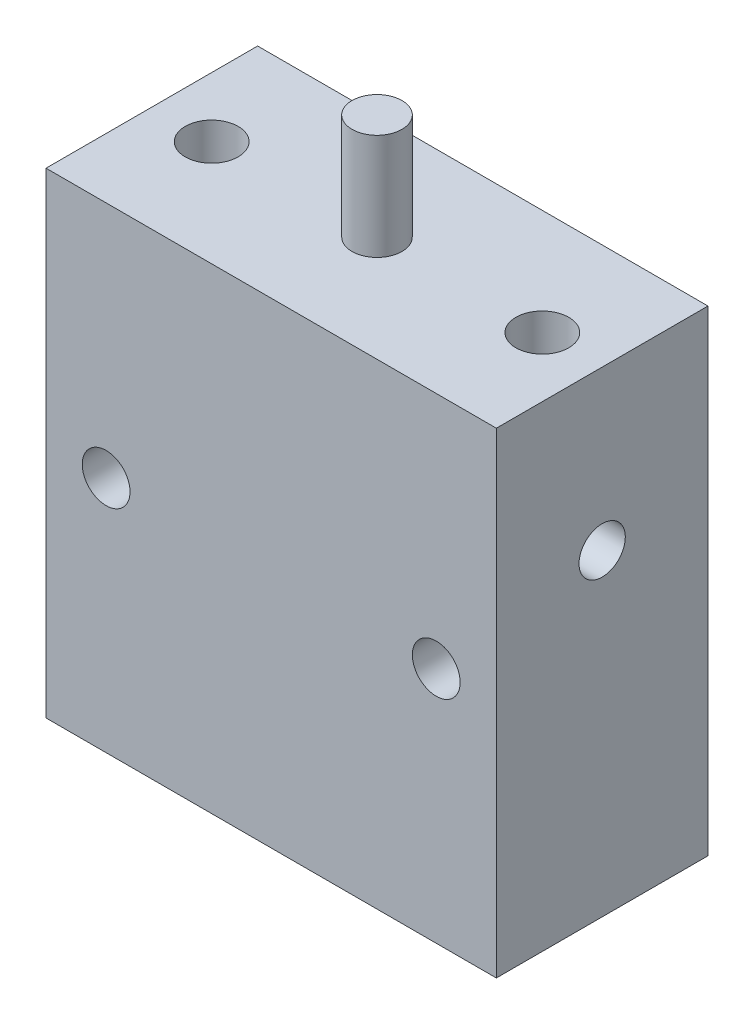
ISO-10303-21;
HEADER;
FILE_DESCRIPTION(('STEP AP214'),'2;1');
FILE_NAME('part.step','',(''),(''),'','','');
FILE_SCHEMA(('AUTOMOTIVE_DESIGN { 1 0 10303 214 1 1 1 1 }'));
ENDSEC;
DATA;
#1=APPLICATION_CONTEXT('core data for automotive mechanical design processes');
#2=APPLICATION_PROTOCOL_DEFINITION('international standard','automotive_design',2000,#1);
#3=PRODUCT_CONTEXT('',#1,'mechanical');
#4=PRODUCT('Part','Part','',(#3));
#5=PRODUCT_RELATED_PRODUCT_CATEGORY('part','',(#4));
#6=PRODUCT_DEFINITION_FORMATION('','',#4);
#7=PRODUCT_DEFINITION_CONTEXT('part definition',#1,'design');
#8=PRODUCT_DEFINITION('design','',#6,#7);
#9=PRODUCT_DEFINITION_SHAPE('','',#8);
#10=(LENGTH_UNIT() NAMED_UNIT(*) SI_UNIT(.MILLI.,.METRE.));
#11=(NAMED_UNIT(*) PLANE_ANGLE_UNIT() SI_UNIT($,.RADIAN.));
#12=(NAMED_UNIT(*) SI_UNIT($,.STERADIAN.) SOLID_ANGLE_UNIT());
#13=UNCERTAINTY_MEASURE_WITH_UNIT(LENGTH_MEASURE(1.E-05),#10,'distance_accuracy_value','');
#14=(GEOMETRIC_REPRESENTATION_CONTEXT(3) GLOBAL_UNCERTAINTY_ASSIGNED_CONTEXT((#13)) GLOBAL_UNIT_ASSIGNED_CONTEXT((#10,
#11,#12)) REPRESENTATION_CONTEXT('',''));
#15=CARTESIAN_POINT('',(0.,0.,0.));
#16=DIRECTION('',(0.,0.,1.));
#17=DIRECTION('',(1.,0.,0.));
#18=AXIS2_PLACEMENT_3D('',#15,#16,#17);
#19=CARTESIAN_POINT('',(-13.5128,38.5572,6.35));
#20=DIRECTION('',(1.,0.,0.));
#21=DIRECTION('',(0.,1.,0.));
#22=AXIS2_PLACEMENT_3D('',#19,#20,#21);
#23=PLANE('',#22);
#24=DIRECTION('',(0.,0.,-1.));
#25=VECTOR('',#24,1.);
#26=CARTESIAN_POINT('',(-13.5128,38.5572,6.35));
#27=LINE('',#26,#25);
#28=CARTESIAN_POINT('',(-13.5128,38.5572,6.35));
#29=VERTEX_POINT('',#28);
#30=CARTESIAN_POINT('',(-13.5128,38.5572,-6.35));
#31=VERTEX_POINT('',#30);
#32=EDGE_CURVE('E420',#29,#31,#27,.T.);
#33=ORIENTED_EDGE('',*,*,#32,.T.);
#34=DIRECTION('',(0.,-1.,0.));
#35=VECTOR('',#34,1.);
#36=CARTESIAN_POINT('',(-13.5128,38.5572,-6.35));
#37=LINE('',#36,#35);
#38=CARTESIAN_POINT('',(-13.5128,9.9822,-6.35));
#39=VERTEX_POINT('',#38);
#40=EDGE_CURVE('E414',#31,#39,#37,.T.);
#41=ORIENTED_EDGE('',*,*,#40,.T.);
#42=DIRECTION('',(0.,0.,-1.));
#43=VECTOR('',#42,1.);
#44=CARTESIAN_POINT('',(-13.5128,9.9822,6.35));
#45=LINE('',#44,#43);
#46=CARTESIAN_POINT('',(-13.5128,9.9822,6.35));
#47=VERTEX_POINT('',#46);
#48=EDGE_CURVE('E367',#47,#39,#45,.T.);
#49=ORIENTED_EDGE('',*,*,#48,.F.);
#50=DIRECTION('',(0.,-1.,0.));
#51=VECTOR('',#50,1.);
#52=CARTESIAN_POINT('',(-13.5128,38.5572,6.35));
#53=LINE('',#52,#51);
#54=EDGE_CURVE('E437',#29,#47,#53,.T.);
#55=ORIENTED_EDGE('',*,*,#54,.F.);
#56=EDGE_LOOP('',(#33,#41,#49,#55));
#57=FACE_BOUND('',#56,.T.);
#58=CARTESIAN_POINT('',(-13.5128,29.0322,0.));
#59=DIRECTION('',(1.,0.,0.));
#60=DIRECTION('',(0.,1.,0.));
#61=AXIS2_PLACEMENT_3D('',#58,#59,#60);
#62=CIRCLE('',#61,1.3890625);
#63=CARTESIAN_POINT('',(-13.5128,30.4212625,0.));
#64=VERTEX_POINT('',#63);
#65=EDGE_CURVE('E485',#64,#64,#62,.F.);
#66=ORIENTED_EDGE('',*,*,#65,.F.);
#67=EDGE_LOOP('',(#66));
#68=FACE_BOUND('',#67,.T.);
#69=ADVANCED_FACE('F360',(#57,#68),#23,.F.);
#70=CARTESIAN_POINT('',(13.5128,38.5572,6.35));
#71=DIRECTION('',(-1.,0.,0.));
#72=DIRECTION('',(0.,-1.,0.));
#73=AXIS2_PLACEMENT_3D('',#70,#71,#72);
#74=PLANE('',#73);
#75=DIRECTION('',(0.,0.,-1.));
#76=VECTOR('',#75,1.);
#77=CARTESIAN_POINT('',(13.5128,9.9822,6.35));
#78=LINE('',#77,#76);
#79=CARTESIAN_POINT('',(13.5128,9.9822,6.35));
#80=VERTEX_POINT('',#79);
#81=CARTESIAN_POINT('',(13.5128,9.9822,-6.35));
#82=VERTEX_POINT('',#81);
#83=EDGE_CURVE('E408',#80,#82,#78,.T.);
#84=ORIENTED_EDGE('',*,*,#83,.T.);
#85=DIRECTION('',(0.,1.,0.));
#86=VECTOR('',#85,1.);
#87=CARTESIAN_POINT('',(13.5128,38.5572,-6.35));
#88=LINE('',#87,#86);
#89=CARTESIAN_POINT('',(13.5128,38.5572,-6.35));
#90=VERTEX_POINT('',#89);
#91=EDGE_CURVE('E417',#82,#90,#88,.T.);
#92=ORIENTED_EDGE('',*,*,#91,.T.);
#93=DIRECTION('',(0.,0.,-1.));
#94=VECTOR('',#93,1.);
#95=CARTESIAN_POINT('',(13.5128,38.5572,6.35));
#96=LINE('',#95,#94);
#97=CARTESIAN_POINT('',(13.5128,38.5572,6.35));
#98=VERTEX_POINT('',#97);
#99=EDGE_CURVE('E443',#98,#90,#96,.T.);
#100=ORIENTED_EDGE('',*,*,#99,.F.);
#101=DIRECTION('',(0.,1.,0.));
#102=VECTOR('',#101,1.);
#103=CARTESIAN_POINT('',(13.5128,38.5572,6.35));
#104=LINE('',#103,#102);
#105=EDGE_CURVE('E379',#80,#98,#104,.T.);
#106=ORIENTED_EDGE('',*,*,#105,.F.);
#107=EDGE_LOOP('',(#84,#92,#100,#106));
#108=FACE_BOUND('',#107,.T.);
#109=CARTESIAN_POINT('',(13.5128,29.0322,0.));
#110=DIRECTION('',(-1.,0.,0.));
#111=DIRECTION('',(0.,-1.,0.));
#112=AXIS2_PLACEMENT_3D('',#109,#110,#111);
#113=CIRCLE('',#112,1.3890625);
#114=CARTESIAN_POINT('',(13.5128,27.6431375,0.));
#115=VERTEX_POINT('',#114);
#116=EDGE_CURVE('E482',#115,#115,#113,.T.);
#117=ORIENTED_EDGE('',*,*,#116,.T.);
#118=EDGE_LOOP('',(#117));
#119=FACE_BOUND('',#118,.T.);
#120=ADVANCED_FACE('F446',(#108,#119),#74,.F.);
#121=CARTESIAN_POINT('',(-13.5128,38.5572,6.35));
#122=DIRECTION('',(0.,-1.,0.));
#123=DIRECTION('',(0.,0.,-1.));
#124=AXIS2_PLACEMENT_3D('',#121,#122,#123);
#125=PLANE('',#124);
#126=CARTESIAN_POINT('',(-9.921875,38.5572,0.));
#127=DIRECTION('',(0.,1.,0.));
#128=DIRECTION('',(0.,0.,-1.));
#129=AXIS2_PLACEMENT_3D('',#126,#127,#128);
#130=CIRCLE('',#129,1.5875);
#131=CARTESIAN_POINT('',(-9.921875,38.5572,1.5875));
#132=VERTEX_POINT('',#131);
#133=EDGE_CURVE('E479',#132,#132,#130,.T.);
#134=ORIENTED_EDGE('',*,*,#133,.F.);
#135=EDGE_LOOP('',(#134));
#136=FACE_BOUND('',#135,.T.);
#137=CARTESIAN_POINT('',(9.921875,38.5572,0.));
#138=DIRECTION('',(0.,1.,0.));
#139=DIRECTION('',(0.,0.,1.));
#140=AXIS2_PLACEMENT_3D('',#137,#138,#139);
#141=CIRCLE('',#140,1.5875);
#142=CARTESIAN_POINT('',(9.921875,38.5572,1.5875));
#143=VERTEX_POINT('',#142);
#144=EDGE_CURVE('E473',#143,#143,#141,.T.);
#145=ORIENTED_EDGE('',*,*,#144,.F.);
#146=EDGE_LOOP('',(#145));
#147=FACE_BOUND('',#146,.T.);
#148=ORIENTED_EDGE('',*,*,#99,.T.);
#149=DIRECTION('',(-1.,0.,0.));
#150=VECTOR('',#149,1.);
#151=CARTESIAN_POINT('',(-13.5128,38.5572,-6.35));
#152=LINE('',#151,#150);
#153=EDGE_CURVE('E429',#90,#31,#152,.T.);
#154=ORIENTED_EDGE('',*,*,#153,.T.);
#155=ORIENTED_EDGE('',*,*,#32,.F.);
#156=DIRECTION('',(-1.,0.,0.));
#157=VECTOR('',#156,1.);
#158=CARTESIAN_POINT('',(-13.5128,38.5572,6.35));
#159=LINE('',#158,#157);
#160=EDGE_CURVE('E374',#98,#29,#159,.T.);
#161=ORIENTED_EDGE('',*,*,#160,.F.);
#162=EDGE_LOOP('',(#148,#154,#155,#161));
#163=FACE_BOUND('',#162,.T.);
#164=CARTESIAN_POINT('',(0.,38.5572,0.));
#165=DIRECTION('',(0.,-1.,0.));
#166=DIRECTION('',(0.,0.,-1.));
#167=AXIS2_PLACEMENT_3D('',#164,#165,#166);
#168=CIRCLE('',#167,1.4986);
#169=CARTESIAN_POINT('',(0.,38.5572,-1.4986));
#170=VERTEX_POINT('',#169);
#171=EDGE_CURVE('E11',#170,#170,#168,.F.);
#172=ORIENTED_EDGE('',*,*,#171,.F.);
#173=EDGE_LOOP('',(#172));
#174=FACE_BOUND('',#173,.T.);
#175=ADVANCED_FACE('F449',(#136,#147,#163,#174),#125,.F.);
#176=CARTESIAN_POINT('',(-13.5128,9.9822,6.35));
#177=DIRECTION('',(0.,0.,1.));
#178=DIRECTION('',(1.,0.,0.));
#179=AXIS2_PLACEMENT_3D('',#176,#177,#178);
#180=PLANE('',#179);
#181=CARTESIAN_POINT('',(-9.906,24.257,6.35));
#182=DIRECTION('',(0.,0.,1.));
#183=DIRECTION('',(1.,0.,0.));
#184=AXIS2_PLACEMENT_3D('',#181,#182,#183);
#185=CIRCLE('',#184,1.4351);
#186=CARTESIAN_POINT('',(-8.4709,24.257,6.35));
#187=VERTEX_POINT('',#186);
#188=EDGE_CURVE('E434',#187,#187,#185,.T.);
#189=ORIENTED_EDGE('',*,*,#188,.F.);
#190=EDGE_LOOP('',(#189));
#191=FACE_BOUND('',#190,.T.);
#192=ORIENTED_EDGE('',*,*,#54,.T.);
#193=DIRECTION('',(1.,0.,0.));
#194=VECTOR('',#193,1.);
#195=CARTESIAN_POINT('',(-13.5128,9.9822,6.35));
#196=LINE('',#195,#194);
#197=EDGE_CURVE('E404',#47,#80,#196,.T.);
#198=ORIENTED_EDGE('',*,*,#197,.T.);
#199=ORIENTED_EDGE('',*,*,#105,.T.);
#200=ORIENTED_EDGE('',*,*,#160,.T.);
#201=EDGE_LOOP('',(#192,#198,#199,#200));
#202=FACE_BOUND('',#201,.T.);
#203=CARTESIAN_POINT('',(9.906,24.257,6.35));
#204=DIRECTION('',(0.,0.,1.));
#205=DIRECTION('',(1.,0.,0.));
#206=AXIS2_PLACEMENT_3D('',#203,#204,#205);
#207=CIRCLE('',#206,1.4351);
#208=CARTESIAN_POINT('',(11.3411,24.257,6.35));
#209=VERTEX_POINT('',#208);
#210=EDGE_CURVE('E431',#209,#209,#207,.T.);
#211=ORIENTED_EDGE('',*,*,#210,.F.);
#212=EDGE_LOOP('',(#211));
#213=FACE_BOUND('',#212,.T.);
#214=ADVANCED_FACE('F451',(#191,#202,#213),#180,.T.);
#215=CARTESIAN_POINT('',(-13.5128,9.9822,6.35));
#216=DIRECTION('',(0.,1.,0.));
#217=DIRECTION('',(0.,0.,1.));
#218=AXIS2_PLACEMENT_3D('',#215,#216,#217);
#219=PLANE('',#218);
#220=ORIENTED_EDGE('',*,*,#48,.T.);
#221=DIRECTION('',(1.,0.,0.));
#222=VECTOR('',#221,1.);
#223=CARTESIAN_POINT('',(-13.5128,9.9822,-6.35));
#224=LINE('',#223,#222);
#225=EDGE_CURVE('E403',#39,#82,#224,.T.);
#226=ORIENTED_EDGE('',*,*,#225,.T.);
#227=ORIENTED_EDGE('',*,*,#83,.F.);
#228=ORIENTED_EDGE('',*,*,#197,.F.);
#229=EDGE_LOOP('',(#220,#226,#227,#228));
#230=FACE_BOUND('',#229,.T.);
#231=ADVANCED_FACE('F401',(#230),#219,.F.);
#232=CARTESIAN_POINT('',(-9.906,24.257,6.35));
#233=DIRECTION('',(0.,0.,-1.));
#234=DIRECTION('',(-1.,0.,0.));
#235=AXIS2_PLACEMENT_3D('',#232,#233,#234);
#236=CYLINDRICAL_SURFACE('',#235,1.4351);
#237=ORIENTED_EDGE('',*,*,#188,.T.);
#238=EDGE_LOOP('',(#237));
#239=FACE_BOUND('',#238,.T.);
#240=CARTESIAN_POINT('',(-9.906,24.257,-6.35));
#241=DIRECTION('',(0.,0.,1.));
#242=DIRECTION('',(1.,0.,0.));
#243=AXIS2_PLACEMENT_3D('',#240,#241,#242);
#244=CIRCLE('',#243,1.4351);
#245=CARTESIAN_POINT('',(-8.4709,24.257,-6.35));
#246=VERTEX_POINT('',#245);
#247=EDGE_CURVE('E421',#246,#246,#244,.T.);
#248=ORIENTED_EDGE('',*,*,#247,.F.);
#249=EDGE_LOOP('',(#248));
#250=FACE_BOUND('',#249,.T.);
#251=ADVANCED_FACE('F461',(#239,#250),#236,.F.);
#252=CARTESIAN_POINT('',(9.906,24.257,6.35));
#253=DIRECTION('',(0.,0.,-1.));
#254=DIRECTION('',(-1.,0.,0.));
#255=AXIS2_PLACEMENT_3D('',#252,#253,#254);
#256=CYLINDRICAL_SURFACE('',#255,1.4351);
#257=ORIENTED_EDGE('',*,*,#210,.T.);
#258=EDGE_LOOP('',(#257));
#259=FACE_BOUND('',#258,.T.);
#260=CARTESIAN_POINT('',(9.906,24.257,-6.35));
#261=DIRECTION('',(0.,0.,1.));
#262=DIRECTION('',(1.,0.,0.));
#263=AXIS2_PLACEMENT_3D('',#260,#261,#262);
#264=CIRCLE('',#263,1.4351);
#265=CARTESIAN_POINT('',(11.3411,24.257,-6.35));
#266=VERTEX_POINT('',#265);
#267=EDGE_CURVE('E424',#266,#266,#264,.T.);
#268=ORIENTED_EDGE('',*,*,#267,.F.);
#269=EDGE_LOOP('',(#268));
#270=FACE_BOUND('',#269,.T.);
#271=ADVANCED_FACE('F458',(#259,#270),#256,.F.);
#272=CARTESIAN_POINT('',(-13.5128,9.9822,-6.35));
#273=DIRECTION('',(0.,0.,1.));
#274=DIRECTION('',(1.,0.,0.));
#275=AXIS2_PLACEMENT_3D('',#272,#273,#274);
#276=PLANE('',#275);
#277=ORIENTED_EDGE('',*,*,#267,.T.);
#278=EDGE_LOOP('',(#277));
#279=FACE_BOUND('',#278,.T.);
#280=ORIENTED_EDGE('',*,*,#247,.T.);
#281=EDGE_LOOP('',(#280));
#282=FACE_BOUND('',#281,.T.);
#283=ORIENTED_EDGE('',*,*,#40,.F.);
#284=ORIENTED_EDGE('',*,*,#153,.F.);
#285=ORIENTED_EDGE('',*,*,#91,.F.);
#286=ORIENTED_EDGE('',*,*,#225,.F.);
#287=EDGE_LOOP('',(#283,#284,#285,#286));
#288=FACE_BOUND('',#287,.T.);
#289=ADVANCED_FACE('F412',(#279,#282,#288),#276,.F.);
#290=CARTESIAN_POINT('',(0.,44.9072,0.));
#291=DIRECTION('',(0.,-1.,0.));
#292=DIRECTION('',(0.,0.,-1.));
#293=AXIS2_PLACEMENT_3D('',#290,#291,#292);
#294=CYLINDRICAL_SURFACE('',#293,1.4986);
#295=CARTESIAN_POINT('',(0.,44.9072,0.));
#296=DIRECTION('',(0.,1.,0.));
#297=DIRECTION('',(0.,0.,1.));
#298=AXIS2_PLACEMENT_3D('',#295,#296,#297);
#299=CIRCLE('',#298,1.4986);
#300=CARTESIAN_POINT('',(0.,44.9072,1.4986));
#301=VERTEX_POINT('',#300);
#302=EDGE_CURVE('E466',#301,#301,#299,.T.);
#303=ORIENTED_EDGE('',*,*,#302,.F.);
#304=EDGE_LOOP('',(#303));
#305=FACE_BOUND('',#304,.T.);
#306=ORIENTED_EDGE('',*,*,#171,.T.);
#307=EDGE_LOOP('',(#306));
#308=FACE_BOUND('',#307,.T.);
#309=ADVANCED_FACE('F517',(#305,#308),#294,.T.);
#310=CARTESIAN_POINT('',(0.,44.9072,0.));
#311=DIRECTION('',(0.,1.,0.));
#312=DIRECTION('',(0.,0.,1.));
#313=AXIS2_PLACEMENT_3D('',#310,#311,#312);
#314=PLANE('',#313);
#315=ORIENTED_EDGE('',*,*,#302,.T.);
#316=EDGE_LOOP('',(#315));
#317=FACE_BOUND('',#316,.T.);
#318=ADVANCED_FACE('F520',(#317),#314,.T.);
#319=CARTESIAN_POINT('',(9.921875,33.7947,0.));
#320=DIRECTION('',(0.,1.,0.));
#321=DIRECTION('',(0.,0.,1.));
#322=AXIS2_PLACEMENT_3D('',#319,#320,#321);
#323=CYLINDRICAL_SURFACE('',#322,1.5875);
#324=CARTESIAN_POINT('',(9.921875,33.7947,0.));
#325=DIRECTION('',(0.,1.,0.));
#326=DIRECTION('',(0.,0.,1.));
#327=AXIS2_PLACEMENT_3D('',#324,#325,#326);
#328=CIRCLE('',#327,1.5875);
#329=CARTESIAN_POINT('',(9.921875,33.7947,1.5875));
#330=VERTEX_POINT('',#329);
#331=EDGE_CURVE('E468',#330,#330,#328,.T.);
#332=CARTESIAN_POINT('',(9.921875,33.7947,1.5875));
#333=CARTESIAN_POINT('',(9.921875,33.844309375,1.5875));
#334=CARTESIAN_POINT('',(9.921875,33.89391875,1.5875));
#335=CARTESIAN_POINT('',(9.921875,33.9931375,1.5875));
#336=CARTESIAN_POINT('',(9.921875,34.042746875,1.5875));
#337=CARTESIAN_POINT('',(9.921875,34.141965625,1.5875));
#338=CARTESIAN_POINT('',(9.921875,34.191575,1.5875));
#339=CARTESIAN_POINT('',(9.921875,34.29079375,1.5875));
#340=CARTESIAN_POINT('',(9.921875,34.340403125,1.5875));
#341=CARTESIAN_POINT('',(9.921875,34.439621875,1.5875));
#342=CARTESIAN_POINT('',(9.921875,34.48923125,1.5875));
#343=CARTESIAN_POINT('',(9.921875,34.58845,1.5875));
#344=CARTESIAN_POINT('',(9.921875,34.638059375,1.5875));
#345=CARTESIAN_POINT('',(9.921875,34.737278125,1.5875));
#346=CARTESIAN_POINT('',(9.921875,34.7868875,1.5875));
#347=CARTESIAN_POINT('',(9.921875,34.88610625,1.5875));
#348=CARTESIAN_POINT('',(9.921875,34.935715625,1.5875));
#349=CARTESIAN_POINT('',(9.921875,35.034934375,1.5875));
#350=CARTESIAN_POINT('',(9.921875,35.08454375,1.5875));
#351=CARTESIAN_POINT('',(9.921875,35.1837625,1.5875));
#352=CARTESIAN_POINT('',(9.921875,35.233371875,1.5875));
#353=CARTESIAN_POINT('',(9.921875,35.332590625,1.5875));
#354=CARTESIAN_POINT('',(9.921875,35.3822,1.5875));
#355=CARTESIAN_POINT('',(9.921875,35.48141875,1.5875));
#356=CARTESIAN_POINT('',(9.921875,35.531028125,1.5875));
#357=CARTESIAN_POINT('',(9.921875,35.630246875,1.5875));
#358=CARTESIAN_POINT('',(9.921875,35.67985625,1.5875));
#359=CARTESIAN_POINT('',(9.921875,35.779075,1.5875));
#360=CARTESIAN_POINT('',(9.921875,35.828684375,1.5875));
#361=CARTESIAN_POINT('',(9.921875,35.927903125,1.5875));
#362=CARTESIAN_POINT('',(9.921875,35.9775125,1.5875));
#363=CARTESIAN_POINT('',(9.921875,36.07673125,1.5875));
#364=CARTESIAN_POINT('',(9.921875,36.126340625,1.5875));
#365=CARTESIAN_POINT('',(9.921875,36.225559375,1.5875));
#366=CARTESIAN_POINT('',(9.921875,36.27516875,1.5875));
#367=CARTESIAN_POINT('',(9.921875,36.3743875,1.5875));
#368=CARTESIAN_POINT('',(9.921875,36.423996875,1.5875));
#369=CARTESIAN_POINT('',(9.921875,36.523215625,1.5875));
#370=CARTESIAN_POINT('',(9.921875,36.572825,1.5875));
#371=CARTESIAN_POINT('',(9.921875,36.67204375,1.5875));
#372=CARTESIAN_POINT('',(9.921875,36.721653125,1.5875));
#373=CARTESIAN_POINT('',(9.921875,36.820871875,1.5875));
#374=CARTESIAN_POINT('',(9.921875,36.87048125,1.5875));
#375=CARTESIAN_POINT('',(9.921875,36.9697,1.5875));
#376=CARTESIAN_POINT('',(9.921875,37.019309375,1.5875));
#377=CARTESIAN_POINT('',(9.921875,37.118528125,1.5875));
#378=CARTESIAN_POINT('',(9.921875,37.1681375,1.5875));
#379=CARTESIAN_POINT('',(9.921875,37.26735625,1.5875));
#380=CARTESIAN_POINT('',(9.921875,37.316965625,1.5875));
#381=CARTESIAN_POINT('',(9.921875,37.416184375,1.5875));
#382=CARTESIAN_POINT('',(9.921875,37.46579375,1.5875));
#383=CARTESIAN_POINT('',(9.921875,37.5650125,1.5875));
#384=CARTESIAN_POINT('',(9.921875,37.614621875,1.5875));
#385=CARTESIAN_POINT('',(9.921875,37.713840625,1.5875));
#386=CARTESIAN_POINT('',(9.921875,37.76345,1.5875));
#387=CARTESIAN_POINT('',(9.921875,37.86266875,1.5875));
#388=CARTESIAN_POINT('',(9.921875,37.912278125,1.5875));
#389=CARTESIAN_POINT('',(9.921875,38.011496875,1.5875));
#390=CARTESIAN_POINT('',(9.921875,38.06110625,1.5875));
#391=CARTESIAN_POINT('',(9.921875,38.160325,1.5875));
#392=CARTESIAN_POINT('',(9.921875,38.209934375,1.5875));
#393=CARTESIAN_POINT('',(9.921875,38.309153125,1.5875));
#394=CARTESIAN_POINT('',(9.921875,38.3587625,1.5875));
#395=CARTESIAN_POINT('',(9.921875,38.45798125,1.5875));
#396=CARTESIAN_POINT('',(9.921875,38.507590625,1.5875));
#397=CARTESIAN_POINT('',(9.921875,38.5572,1.5875));
#398=B_SPLINE_CURVE_WITH_KNOTS('',3,(#332,#333,#334,#335,#336,#337,#338,#339,#340,#341,#342,
#343,#344,#345,#346,#347,#348,#349,#350,#351,#352,#353,#354,#355,#356,#357,#358,#359,#360,#361,
#362,#363,#364,#365,#366,#367,#368,#369,#370,#371,#372,#373,#374,#375,#376,#377,#378,#379,#380,
#381,#382,#383,#384,#385,#386,#387,#388,#389,#390,#391,#392,#393,#394,#395,#396,#397),
.UNSPECIFIED.,.F.,.F.,(4,2,2,2,2,2,2,2,2,2,2,2,2,2,2,2,2,2,2,2,2,2,2,2,2,2,2,2,2,2,2,2,4),(0.,
0.148828124999993,0.297656249999993,0.446484374999993,0.595312499999993,0.744140624999994,
0.892968749999994,1.04179687499999,1.19062499999999,1.33945312499999,1.48828124999999,
1.63710937499999,1.78593749999999,1.93476562499999,2.08359374999999,2.23242187499999,
2.38124999999999,2.53007812499999,2.67890624999999,2.82773437499999,2.97656249999999,
3.12539062499999,3.27421874999999,3.42304687499999,3.571875,3.720703125,3.86953125,4.018359375,
4.1671875,4.316015625,4.46484375,4.613671875,4.7625),.UNSPECIFIED.);
#399=EDGE_CURVE('BSEAM524',#330,#143,#398,.T.);
#400=ORIENTED_EDGE('',*,*,#331,.F.);
#401=ORIENTED_EDGE('',*,*,#144,.T.);
#402=ORIENTED_EDGE('',*,*,#399,.T.);
#403=ORIENTED_EDGE('',*,*,#399,.F.);
#404=EDGE_LOOP('',(#400,#402,#401,#403));
#405=FACE_BOUND('',#404,.T.);
#406=ADVANCED_FACE('F524',(#405),#323,.F.);
#407=CARTESIAN_POINT('',(9.921875,33.7947,0.));
#408=DIRECTION('',(0.,1.,0.));
#409=DIRECTION('',(0.,0.,1.));
#410=AXIS2_PLACEMENT_3D('',#407,#408,#409);
#411=PLANE('',#410);
#412=ORIENTED_EDGE('',*,*,#331,.T.);
#413=EDGE_LOOP('',(#412));
#414=FACE_BOUND('',#413,.T.);
#415=ADVANCED_FACE('F528',(#414),#411,.T.);
#416=CARTESIAN_POINT('',(-9.921875,33.7947,0.));
#417=DIRECTION('',(0.,1.,0.));
#418=DIRECTION('',(0.,0.,1.));
#419=AXIS2_PLACEMENT_3D('',#416,#417,#418);
#420=CYLINDRICAL_SURFACE('',#419,1.5875);
#421=CARTESIAN_POINT('',(-9.921875,33.7947,0.));
#422=DIRECTION('',(0.,1.,0.));
#423=DIRECTION('',(0.,0.,-1.));
#424=AXIS2_PLACEMENT_3D('',#421,#422,#423);
#425=CIRCLE('',#424,1.5875);
#426=CARTESIAN_POINT('',(-9.921875,33.7947,1.5875));
#427=VERTEX_POINT('',#426);
#428=EDGE_CURVE('E476',#427,#427,#425,.T.);
#429=CARTESIAN_POINT('',(-9.921875,33.7947,1.5875));
#430=CARTESIAN_POINT('',(-9.921875,33.844309375,1.5875));
#431=CARTESIAN_POINT('',(-9.921875,33.89391875,1.5875));
#432=CARTESIAN_POINT('',(-9.921875,33.9931375,1.5875));
#433=CARTESIAN_POINT('',(-9.921875,34.042746875,1.5875));
#434=CARTESIAN_POINT('',(-9.921875,34.141965625,1.5875));
#435=CARTESIAN_POINT('',(-9.921875,34.191575,1.5875));
#436=CARTESIAN_POINT('',(-9.921875,34.29079375,1.5875));
#437=CARTESIAN_POINT('',(-9.921875,34.340403125,1.5875));
#438=CARTESIAN_POINT('',(-9.921875,34.439621875,1.5875));
#439=CARTESIAN_POINT('',(-9.921875,34.48923125,1.5875));
#440=CARTESIAN_POINT('',(-9.921875,34.58845,1.5875));
#441=CARTESIAN_POINT('',(-9.921875,34.638059375,1.5875));
#442=CARTESIAN_POINT('',(-9.921875,34.737278125,1.5875));
#443=CARTESIAN_POINT('',(-9.921875,34.7868875,1.5875));
#444=CARTESIAN_POINT('',(-9.921875,34.88610625,1.5875));
#445=CARTESIAN_POINT('',(-9.921875,34.935715625,1.5875));
#446=CARTESIAN_POINT('',(-9.921875,35.034934375,1.5875));
#447=CARTESIAN_POINT('',(-9.921875,35.08454375,1.5875));
#448=CARTESIAN_POINT('',(-9.921875,35.1837625,1.5875));
#449=CARTESIAN_POINT('',(-9.921875,35.233371875,1.5875));
#450=CARTESIAN_POINT('',(-9.921875,35.332590625,1.5875));
#451=CARTESIAN_POINT('',(-9.921875,35.3822,1.5875));
#452=CARTESIAN_POINT('',(-9.921875,35.48141875,1.5875));
#453=CARTESIAN_POINT('',(-9.921875,35.531028125,1.5875));
#454=CARTESIAN_POINT('',(-9.921875,35.630246875,1.5875));
#455=CARTESIAN_POINT('',(-9.921875,35.67985625,1.5875));
#456=CARTESIAN_POINT('',(-9.921875,35.779075,1.5875));
#457=CARTESIAN_POINT('',(-9.921875,35.828684375,1.5875));
#458=CARTESIAN_POINT('',(-9.921875,35.927903125,1.5875));
#459=CARTESIAN_POINT('',(-9.921875,35.9775125,1.5875));
#460=CARTESIAN_POINT('',(-9.921875,36.07673125,1.5875));
#461=CARTESIAN_POINT('',(-9.921875,36.126340625,1.5875));
#462=CARTESIAN_POINT('',(-9.921875,36.225559375,1.5875));
#463=CARTESIAN_POINT('',(-9.921875,36.27516875,1.5875));
#464=CARTESIAN_POINT('',(-9.921875,36.3743875,1.5875));
#465=CARTESIAN_POINT('',(-9.921875,36.423996875,1.5875));
#466=CARTESIAN_POINT('',(-9.921875,36.523215625,1.5875));
#467=CARTESIAN_POINT('',(-9.921875,36.572825,1.5875));
#468=CARTESIAN_POINT('',(-9.921875,36.67204375,1.5875));
#469=CARTESIAN_POINT('',(-9.921875,36.721653125,1.5875));
#470=CARTESIAN_POINT('',(-9.921875,36.820871875,1.5875));
#471=CARTESIAN_POINT('',(-9.921875,36.87048125,1.5875));
#472=CARTESIAN_POINT('',(-9.921875,36.9697,1.5875));
#473=CARTESIAN_POINT('',(-9.921875,37.019309375,1.5875));
#474=CARTESIAN_POINT('',(-9.921875,37.118528125,1.5875));
#475=CARTESIAN_POINT('',(-9.921875,37.1681375,1.5875));
#476=CARTESIAN_POINT('',(-9.921875,37.26735625,1.5875));
#477=CARTESIAN_POINT('',(-9.921875,37.316965625,1.5875));
#478=CARTESIAN_POINT('',(-9.921875,37.416184375,1.5875));
#479=CARTESIAN_POINT('',(-9.921875,37.46579375,1.5875));
#480=CARTESIAN_POINT('',(-9.921875,37.5650125,1.5875));
#481=CARTESIAN_POINT('',(-9.921875,37.614621875,1.5875));
#482=CARTESIAN_POINT('',(-9.921875,37.713840625,1.5875));
#483=CARTESIAN_POINT('',(-9.921875,37.76345,1.5875));
#484=CARTESIAN_POINT('',(-9.921875,37.86266875,1.5875));
#485=CARTESIAN_POINT('',(-9.921875,37.912278125,1.5875));
#486=CARTESIAN_POINT('',(-9.921875,38.011496875,1.5875));
#487=CARTESIAN_POINT('',(-9.921875,38.06110625,1.5875));
#488=CARTESIAN_POINT('',(-9.921875,38.160325,1.5875));
#489=CARTESIAN_POINT('',(-9.921875,38.209934375,1.5875));
#490=CARTESIAN_POINT('',(-9.921875,38.309153125,1.5875));
#491=CARTESIAN_POINT('',(-9.921875,38.3587625,1.5875));
#492=CARTESIAN_POINT('',(-9.921875,38.45798125,1.5875));
#493=CARTESIAN_POINT('',(-9.921875,38.507590625,1.5875));
#494=CARTESIAN_POINT('',(-9.921875,38.5572,1.5875));
#495=B_SPLINE_CURVE_WITH_KNOTS('',3,(#429,#430,#431,#432,#433,#434,#435,#436,#437,#438,#439,
#440,#441,#442,#443,#444,#445,#446,#447,#448,#449,#450,#451,#452,#453,#454,#455,#456,#457,#458,
#459,#460,#461,#462,#463,#464,#465,#466,#467,#468,#469,#470,#471,#472,#473,#474,#475,#476,#477,
#478,#479,#480,#481,#482,#483,#484,#485,#486,#487,#488,#489,#490,#491,#492,#493,#494),
.UNSPECIFIED.,.F.,.F.,(4,2,2,2,2,2,2,2,2,2,2,2,2,2,2,2,2,2,2,2,2,2,2,2,2,2,2,2,2,2,2,2,4),(0.,
0.148828124999993,0.297656249999993,0.446484374999993,0.595312499999993,0.744140624999994,
0.892968749999994,1.04179687499999,1.19062499999999,1.33945312499999,1.48828124999999,
1.63710937499999,1.78593749999999,1.93476562499999,2.08359374999999,2.23242187499999,
2.38124999999999,2.53007812499999,2.67890624999999,2.82773437499999,2.97656249999999,
3.12539062499999,3.27421874999999,3.42304687499999,3.571875,3.720703125,3.86953125,4.018359375,
4.1671875,4.316015625,4.46484375,4.613671875,4.7625),.UNSPECIFIED.);
#496=EDGE_CURVE('BSEAM532',#427,#132,#495,.T.);
#497=ORIENTED_EDGE('',*,*,#428,.F.);
#498=ORIENTED_EDGE('',*,*,#133,.T.);
#499=ORIENTED_EDGE('',*,*,#496,.T.);
#500=ORIENTED_EDGE('',*,*,#496,.F.);
#501=EDGE_LOOP('',(#497,#499,#498,#500));
#502=FACE_BOUND('',#501,.T.);
#503=ADVANCED_FACE('F532',(#502),#420,.F.);
#504=CARTESIAN_POINT('',(-9.921875,33.7947,0.));
#505=DIRECTION('',(0.,-1.,0.));
#506=DIRECTION('',(0.,0.,-1.));
#507=AXIS2_PLACEMENT_3D('',#504,#505,#506);
#508=PLANE('',#507);
#509=ORIENTED_EDGE('',*,*,#428,.T.);
#510=EDGE_LOOP('',(#509));
#511=FACE_BOUND('',#510,.T.);
#512=ADVANCED_FACE('F536',(#511),#508,.F.);
#513=CARTESIAN_POINT('',(13.5138,29.0322,0.));
#514=DIRECTION('',(-1.,0.,0.));
#515=DIRECTION('',(0.,0.,1.));
#516=AXIS2_PLACEMENT_3D('',#513,#514,#515);
#517=CYLINDRICAL_SURFACE('',#516,1.3890625);
#518=ORIENTED_EDGE('',*,*,#116,.F.);
#519=EDGE_LOOP('',(#518));
#520=FACE_BOUND('',#519,.T.);
#521=ORIENTED_EDGE('',*,*,#65,.T.);
#522=EDGE_LOOP('',(#521));
#523=FACE_BOUND('',#522,.T.);
#524=ADVANCED_FACE('F489',(#520,#523),#517,.F.);
#525=CLOSED_SHELL('',(#69,#120,#175,#214,#231,#251,#271,#289,#309,#318,#406,#415,#503,#512,#524));
#526=MANIFOLD_SOLID_BREP('B2',#525);
#527=ADVANCED_BREP_SHAPE_REPRESENTATION('',(#18,#526),#14);
#528=SHAPE_DEFINITION_REPRESENTATION(#9,#527);
ENDSEC;
END-ISO-10303-21;
